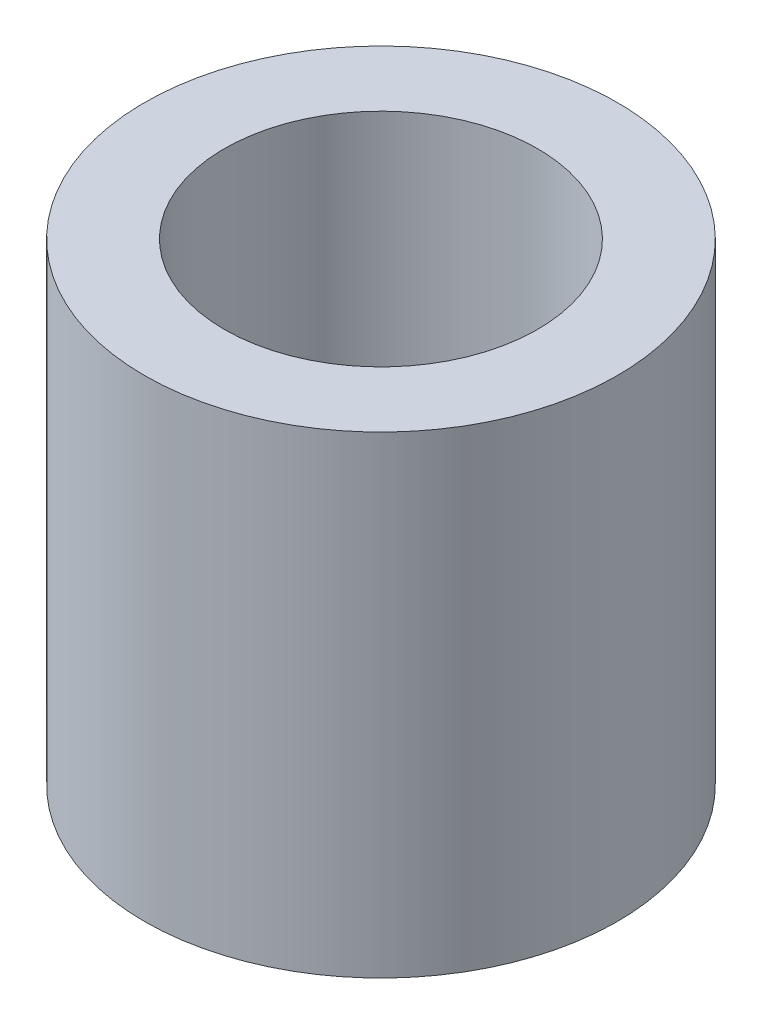
ISO-10303-21;
HEADER;
FILE_DESCRIPTION(('STEP AP214'),'2;1');
FILE_NAME('part.step','',(''),(''),'','','');
FILE_SCHEMA(('AUTOMOTIVE_DESIGN { 1 0 10303 214 1 1 1 1 }'));
ENDSEC;
DATA;
#1=APPLICATION_CONTEXT('core data for automotive mechanical design processes');
#2=APPLICATION_PROTOCOL_DEFINITION('international standard','automotive_design',2000,#1);
#3=PRODUCT_CONTEXT('',#1,'mechanical');
#4=PRODUCT('Part','Part','',(#3));
#5=PRODUCT_RELATED_PRODUCT_CATEGORY('part','',(#4));
#6=PRODUCT_DEFINITION_FORMATION('','',#4);
#7=PRODUCT_DEFINITION_CONTEXT('part definition',#1,'design');
#8=PRODUCT_DEFINITION('design','',#6,#7);
#9=PRODUCT_DEFINITION_SHAPE('','',#8);
#10=(LENGTH_UNIT() NAMED_UNIT(*) SI_UNIT(.MILLI.,.METRE.));
#11=(NAMED_UNIT(*) PLANE_ANGLE_UNIT() SI_UNIT($,.RADIAN.));
#12=(NAMED_UNIT(*) SI_UNIT($,.STERADIAN.) SOLID_ANGLE_UNIT());
#13=UNCERTAINTY_MEASURE_WITH_UNIT(LENGTH_MEASURE(1.E-05),#10,'distance_accuracy_value','');
#14=(GEOMETRIC_REPRESENTATION_CONTEXT(3) GLOBAL_UNCERTAINTY_ASSIGNED_CONTEXT((#13)) GLOBAL_UNIT_ASSIGNED_CONTEXT((#10,
#11,#12)) REPRESENTATION_CONTEXT('',''));
#15=CARTESIAN_POINT('',(0.,0.,0.));
#16=DIRECTION('',(0.,0.,1.));
#17=DIRECTION('',(1.,0.,0.));
#18=AXIS2_PLACEMENT_3D('',#15,#16,#17);
#19=CARTESIAN_POINT('',(0.,20.,0.));
#20=DIRECTION('',(0.,-1.,0.));
#21=DIRECTION('',(0.,0.,-1.));
#22=AXIS2_PLACEMENT_3D('',#19,#20,#21);
#23=CYLINDRICAL_SURFACE('',#22,4.5);
#24=CARTESIAN_POINT('',(0.,7.,0.));
#25=DIRECTION('',(0.,1.,0.));
#26=DIRECTION('',(0.,0.,1.));
#27=AXIS2_PLACEMENT_3D('',#24,#25,#26);
#28=CIRCLE('',#27,4.5);
#29=CARTESIAN_POINT('',(0.,7.,4.5));
#30=VERTEX_POINT('',#29);
#31=EDGE_CURVE('E52',#30,#30,#28,.T.);
#32=ORIENTED_EDGE('',*,*,#31,.T.);
#33=EDGE_LOOP('',(#32));
#34=FACE_BOUND('',#33,.T.);
#35=CARTESIAN_POINT('',(0.,5.,0.));
#36=DIRECTION('',(0.,-1.,0.));
#37=DIRECTION('',(0.,0.,-1.));
#38=AXIS2_PLACEMENT_3D('',#35,#36,#37);
#39=CIRCLE('',#38,4.5);
#40=CARTESIAN_POINT('',(0.,5.,-4.5));
#41=VERTEX_POINT('',#40);
#42=EDGE_CURVE('E41',#41,#41,#39,.T.);
#43=ORIENTED_EDGE('',*,*,#42,.T.);
#44=EDGE_LOOP('',(#43));
#45=FACE_BOUND('',#44,.T.);
#46=ADVANCED_FACE('F37',(#34,#45),#23,.F.);
#47=CARTESIAN_POINT('',(0.,20.,0.));
#48=DIRECTION('',(0.,1.,0.));
#49=DIRECTION('',(0.,0.,1.));
#50=AXIS2_PLACEMENT_3D('',#47,#48,#49);
#51=PLANE('',#50);
#52=CARTESIAN_POINT('',(0.,20.,0.));
#53=DIRECTION('',(0.,1.,0.));
#54=DIRECTION('',(0.,0.,1.));
#55=AXIS2_PLACEMENT_3D('',#52,#53,#54);
#56=CIRCLE('',#55,6.625);
#57=CARTESIAN_POINT('',(0.,20.,6.625));
#58=VERTEX_POINT('',#57);
#59=EDGE_CURVE('E55',#58,#58,#56,.T.);
#60=ORIENTED_EDGE('',*,*,#59,.F.);
#61=EDGE_LOOP('',(#60));
#62=FACE_BOUND('',#61,.T.);
#63=CARTESIAN_POINT('',(0.,20.,0.));
#64=DIRECTION('',(0.,1.,0.));
#65=DIRECTION('',(0.,0.,1.));
#66=AXIS2_PLACEMENT_3D('',#63,#64,#65);
#67=CIRCLE('',#66,10.);
#68=CARTESIAN_POINT('',(0.,20.,10.));
#69=VERTEX_POINT('',#68);
#70=EDGE_CURVE('E10',#69,#69,#67,.T.);
#71=ORIENTED_EDGE('',*,*,#70,.T.);
#72=EDGE_LOOP('',(#71));
#73=FACE_BOUND('',#72,.T.);
#74=ADVANCED_FACE('F94',(#62,#73),#51,.T.);
#75=CARTESIAN_POINT('',(0.,0.,0.));
#76=DIRECTION('',(0.,1.,0.));
#77=DIRECTION('',(0.,0.,1.));
#78=AXIS2_PLACEMENT_3D('',#75,#76,#77);
#79=PLANE('',#78);
#80=CARTESIAN_POINT('',(0.,0.,0.));
#81=DIRECTION('',(0.,-1.,0.));
#82=DIRECTION('',(0.,0.,-1.));
#83=AXIS2_PLACEMENT_3D('',#80,#81,#82);
#84=CIRCLE('',#83,6.625);
#85=CARTESIAN_POINT('',(0.,0.,-6.625));
#86=VERTEX_POINT('',#85);
#87=EDGE_CURVE('E69',#86,#86,#84,.T.);
#88=ORIENTED_EDGE('',*,*,#87,.F.);
#89=EDGE_LOOP('',(#88));
#90=FACE_BOUND('',#89,.T.);
#91=CARTESIAN_POINT('',(0.,0.,0.));
#92=DIRECTION('',(0.,1.,0.));
#93=DIRECTION('',(0.,0.,1.));
#94=AXIS2_PLACEMENT_3D('',#91,#92,#93);
#95=CIRCLE('',#94,10.);
#96=CARTESIAN_POINT('',(0.,0.,10.));
#97=VERTEX_POINT('',#96);
#98=EDGE_CURVE('E46',#97,#97,#95,.T.);
#99=ORIENTED_EDGE('',*,*,#98,.F.);
#100=EDGE_LOOP('',(#99));
#101=FACE_BOUND('',#100,.T.);
#102=ADVANCED_FACE('F99',(#90,#101),#79,.F.);
#103=CARTESIAN_POINT('',(0.,20.,0.));
#104=DIRECTION('',(0.,-1.,0.));
#105=DIRECTION('',(0.,0.,-1.));
#106=AXIS2_PLACEMENT_3D('',#103,#104,#105);
#107=CYLINDRICAL_SURFACE('',#106,10.);
#108=ORIENTED_EDGE('',*,*,#70,.F.);
#109=EDGE_LOOP('',(#108));
#110=FACE_BOUND('',#109,.T.);
#111=ORIENTED_EDGE('',*,*,#98,.T.);
#112=EDGE_LOOP('',(#111));
#113=FACE_BOUND('',#112,.T.);
#114=ADVANCED_FACE('F39',(#110,#113),#107,.T.);
#115=CARTESIAN_POINT('',(0.,7.,0.));
#116=DIRECTION('',(0.,1.,0.));
#117=DIRECTION('',(0.,0.,1.));
#118=AXIS2_PLACEMENT_3D('',#115,#116,#117);
#119=CYLINDRICAL_SURFACE('',#118,6.625);
#120=CARTESIAN_POINT('',(0.,7.,0.));
#121=DIRECTION('',(0.,1.,0.));
#122=DIRECTION('',(0.,0.,1.));
#123=AXIS2_PLACEMENT_3D('',#120,#121,#122);
#124=CIRCLE('',#123,6.625);
#125=CARTESIAN_POINT('',(0.,7.,6.625));
#126=VERTEX_POINT('',#125);
#127=EDGE_CURVE('E59',#126,#126,#124,.T.);
#128=ORIENTED_EDGE('',*,*,#127,.F.);
#129=EDGE_LOOP('',(#128));
#130=FACE_BOUND('',#129,.T.);
#131=ORIENTED_EDGE('',*,*,#59,.T.);
#132=EDGE_LOOP('',(#131));
#133=FACE_BOUND('',#132,.T.);
#134=ADVANCED_FACE('F103',(#130,#133),#119,.F.);
#135=CARTESIAN_POINT('',(0.,7.,0.));
#136=DIRECTION('',(0.,1.,0.));
#137=DIRECTION('',(0.,0.,1.));
#138=AXIS2_PLACEMENT_3D('',#135,#136,#137);
#139=PLANE('',#138);
#140=ORIENTED_EDGE('',*,*,#31,.F.);
#141=EDGE_LOOP('',(#140));
#142=FACE_BOUND('',#141,.T.);
#143=ORIENTED_EDGE('',*,*,#127,.T.);
#144=EDGE_LOOP('',(#143));
#145=FACE_BOUND('',#144,.T.);
#146=ADVANCED_FACE('F90',(#142,#145),#139,.T.);
#147=CARTESIAN_POINT('',(0.,5.,0.));
#148=DIRECTION('',(0.,-1.,0.));
#149=DIRECTION('',(0.,0.,-1.));
#150=AXIS2_PLACEMENT_3D('',#147,#148,#149);
#151=CYLINDRICAL_SURFACE('',#150,6.625);
#152=CARTESIAN_POINT('',(0.,5.,0.));
#153=DIRECTION('',(0.,-1.,0.));
#154=DIRECTION('',(0.,0.,-1.));
#155=AXIS2_PLACEMENT_3D('',#152,#153,#154);
#156=CIRCLE('',#155,6.625);
#157=CARTESIAN_POINT('',(0.,5.,-6.625));
#158=VERTEX_POINT('',#157);
#159=EDGE_CURVE('E73',#158,#158,#156,.T.);
#160=ORIENTED_EDGE('',*,*,#159,.F.);
#161=EDGE_LOOP('',(#160));
#162=FACE_BOUND('',#161,.T.);
#163=ORIENTED_EDGE('',*,*,#87,.T.);
#164=EDGE_LOOP('',(#163));
#165=FACE_BOUND('',#164,.T.);
#166=ADVANCED_FACE('F85',(#162,#165),#151,.F.);
#167=CARTESIAN_POINT('',(0.,5.,0.));
#168=DIRECTION('',(0.,-1.,0.));
#169=DIRECTION('',(0.,0.,-1.));
#170=AXIS2_PLACEMENT_3D('',#167,#168,#169);
#171=PLANE('',#170);
#172=ORIENTED_EDGE('',*,*,#42,.F.);
#173=EDGE_LOOP('',(#172));
#174=FACE_BOUND('',#173,.T.);
#175=ORIENTED_EDGE('',*,*,#159,.T.);
#176=EDGE_LOOP('',(#175));
#177=FACE_BOUND('',#176,.T.);
#178=ADVANCED_FACE('F83',(#174,#177),#171,.T.);
#179=CLOSED_SHELL('',(#46,#74,#102,#114,#134,#146,#166,#178));
#180=MANIFOLD_SOLID_BREP('B2',#179);
#181=ADVANCED_BREP_SHAPE_REPRESENTATION('',(#18,#180),#14);
#182=SHAPE_DEFINITION_REPRESENTATION(#9,#181);
ENDSEC;
END-ISO-10303-21;
